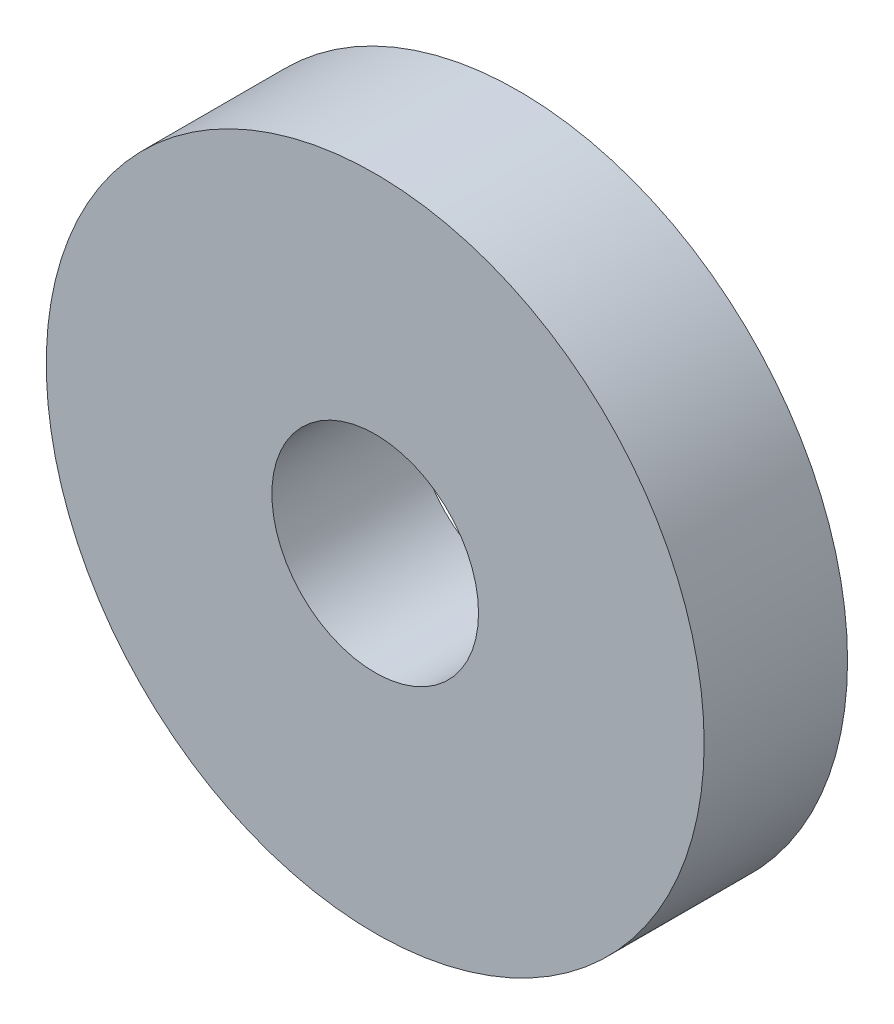
ISO-10303-21;
HEADER;
FILE_DESCRIPTION(('STEP AP214'),'2;1');
FILE_NAME('part.step','',(''),(''),'','','');
FILE_SCHEMA(('AUTOMOTIVE_DESIGN { 1 0 10303 214 1 1 1 1 }'));
ENDSEC;
DATA;
#1=APPLICATION_CONTEXT('core data for automotive mechanical design processes');
#2=APPLICATION_PROTOCOL_DEFINITION('international standard','automotive_design',2000,#1);
#3=PRODUCT_CONTEXT('',#1,'mechanical');
#4=PRODUCT('Part','Part','',(#3));
#5=PRODUCT_RELATED_PRODUCT_CATEGORY('part','',(#4));
#6=PRODUCT_DEFINITION_FORMATION('','',#4);
#7=PRODUCT_DEFINITION_CONTEXT('part definition',#1,'design');
#8=PRODUCT_DEFINITION('design','',#6,#7);
#9=PRODUCT_DEFINITION_SHAPE('','',#8);
#10=(LENGTH_UNIT() NAMED_UNIT(*) SI_UNIT(.MILLI.,.METRE.));
#11=(NAMED_UNIT(*) PLANE_ANGLE_UNIT() SI_UNIT($,.RADIAN.));
#12=(NAMED_UNIT(*) SI_UNIT($,.STERADIAN.) SOLID_ANGLE_UNIT());
#13=UNCERTAINTY_MEASURE_WITH_UNIT(LENGTH_MEASURE(1.E-05),#10,'distance_accuracy_value','');
#14=(GEOMETRIC_REPRESENTATION_CONTEXT(3) GLOBAL_UNCERTAINTY_ASSIGNED_CONTEXT((#13)) GLOBAL_UNIT_ASSIGNED_CONTEXT((#10,
#11,#12)) REPRESENTATION_CONTEXT('',''));
#15=CARTESIAN_POINT('',(0.,0.,0.));
#16=DIRECTION('',(0.,0.,1.));
#17=DIRECTION('',(1.,0.,0.));
#18=AXIS2_PLACEMENT_3D('',#15,#16,#17);
#19=CARTESIAN_POINT('',(0.,0.,-1.7272));
#20=DIRECTION('',(0.,0.,1.));
#21=DIRECTION('',(1.,0.,0.));
#22=AXIS2_PLACEMENT_3D('',#19,#20,#21);
#23=CYLINDRICAL_SURFACE('',#22,3.9624);
#24=CARTESIAN_POINT('',(0.,0.,-1.7272));
#25=DIRECTION('',(0.,0.,1.));
#26=DIRECTION('',(1.,0.,0.));
#27=AXIS2_PLACEMENT_3D('',#24,#25,#26);
#28=CIRCLE('',#27,3.9624);
#29=CARTESIAN_POINT('',(3.9624,0.,-1.7272));
#30=VERTEX_POINT('',#29);
#31=EDGE_CURVE('E10',#30,#30,#28,.T.);
#32=ORIENTED_EDGE('',*,*,#31,.T.);
#33=EDGE_LOOP('',(#32));
#34=FACE_BOUND('',#33,.T.);
#35=CARTESIAN_POINT('',(0.,0.,0.));
#36=DIRECTION('',(0.,0.,1.));
#37=DIRECTION('',(1.,0.,0.));
#38=AXIS2_PLACEMENT_3D('',#35,#36,#37);
#39=CIRCLE('',#38,3.9624);
#40=CARTESIAN_POINT('',(3.9624,0.,0.));
#41=VERTEX_POINT('',#40);
#42=EDGE_CURVE('E33',#41,#41,#39,.T.);
#43=ORIENTED_EDGE('',*,*,#42,.F.);
#44=EDGE_LOOP('',(#43));
#45=FACE_BOUND('',#44,.T.);
#46=ADVANCED_FACE('F30',(#34,#45),#23,.T.);
#47=CARTESIAN_POINT('',(0.,0.,-1.7272));
#48=DIRECTION('',(0.,0.,1.));
#49=DIRECTION('',(1.,0.,0.));
#50=AXIS2_PLACEMENT_3D('',#47,#48,#49);
#51=PLANE('',#50);
#52=CARTESIAN_POINT('',(0.,0.,-1.7272));
#53=DIRECTION('',(0.,0.,1.));
#54=DIRECTION('',(1.,0.,0.));
#55=AXIS2_PLACEMENT_3D('',#52,#53,#54);
#56=CIRCLE('',#55,1.2446);
#57=CARTESIAN_POINT('',(1.2446,0.,-1.7272));
#58=VERTEX_POINT('',#57);
#59=EDGE_CURVE('E40',#58,#58,#56,.T.);
#60=ORIENTED_EDGE('',*,*,#59,.T.);
#61=EDGE_LOOP('',(#60));
#62=FACE_BOUND('',#61,.T.);
#63=ORIENTED_EDGE('',*,*,#31,.F.);
#64=EDGE_LOOP('',(#63));
#65=FACE_BOUND('',#64,.T.);
#66=ADVANCED_FACE('F48',(#62,#65),#51,.F.);
#67=CARTESIAN_POINT('',(0.,0.,0.));
#68=DIRECTION('',(0.,0.,1.));
#69=DIRECTION('',(1.,0.,0.));
#70=AXIS2_PLACEMENT_3D('',#67,#68,#69);
#71=PLANE('',#70);
#72=CARTESIAN_POINT('',(0.,0.,0.));
#73=DIRECTION('',(0.,0.,1.));
#74=DIRECTION('',(1.,0.,0.));
#75=AXIS2_PLACEMENT_3D('',#72,#73,#74);
#76=CIRCLE('',#75,1.2446);
#77=CARTESIAN_POINT('',(1.2446,0.,0.));
#78=VERTEX_POINT('',#77);
#79=EDGE_CURVE('E42',#78,#78,#76,.T.);
#80=ORIENTED_EDGE('',*,*,#79,.F.);
#81=EDGE_LOOP('',(#80));
#82=FACE_BOUND('',#81,.T.);
#83=ORIENTED_EDGE('',*,*,#42,.T.);
#84=EDGE_LOOP('',(#83));
#85=FACE_BOUND('',#84,.T.);
#86=ADVANCED_FACE('F54',(#82,#85),#71,.T.);
#87=CARTESIAN_POINT('',(0.,0.,-1.7272));
#88=DIRECTION('',(0.,0.,1.));
#89=DIRECTION('',(1.,0.,0.));
#90=AXIS2_PLACEMENT_3D('',#87,#88,#89);
#91=CYLINDRICAL_SURFACE('',#90,1.2446);
#92=ORIENTED_EDGE('',*,*,#59,.F.);
#93=EDGE_LOOP('',(#92));
#94=FACE_BOUND('',#93,.T.);
#95=ORIENTED_EDGE('',*,*,#79,.T.);
#96=EDGE_LOOP('',(#95));
#97=FACE_BOUND('',#96,.T.);
#98=ADVANCED_FACE('F51',(#94,#97),#91,.F.);
#99=CLOSED_SHELL('',(#46,#66,#86,#98));
#100=MANIFOLD_SOLID_BREP('B2',#99);
#101=ADVANCED_BREP_SHAPE_REPRESENTATION('',(#18,#100),#14);
#102=SHAPE_DEFINITION_REPRESENTATION(#9,#101);
ENDSEC;
END-ISO-10303-21;
